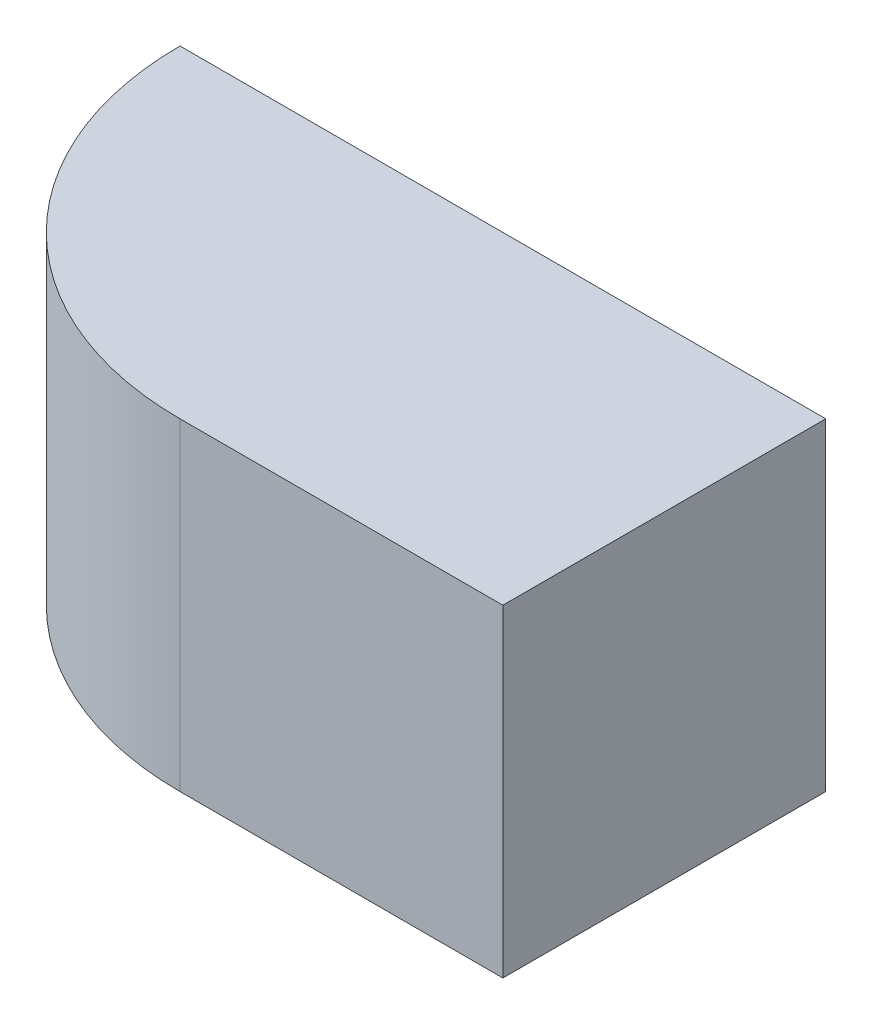
ISO-10303-21;
HEADER;
FILE_DESCRIPTION(('STEP AP214'),'2;1');
FILE_NAME('part.step','',(''),(''),'','','');
FILE_SCHEMA(('AUTOMOTIVE_DESIGN { 1 0 10303 214 1 1 1 1 }'));
ENDSEC;
DATA;
#1=APPLICATION_CONTEXT('core data for automotive mechanical design processes');
#2=APPLICATION_PROTOCOL_DEFINITION('international standard','automotive_design',2000,#1);
#3=PRODUCT_CONTEXT('',#1,'mechanical');
#4=PRODUCT('Part','Part','',(#3));
#5=PRODUCT_RELATED_PRODUCT_CATEGORY('part','',(#4));
#6=PRODUCT_DEFINITION_FORMATION('','',#4);
#7=PRODUCT_DEFINITION_CONTEXT('part definition',#1,'design');
#8=PRODUCT_DEFINITION('design','',#6,#7);
#9=PRODUCT_DEFINITION_SHAPE('','',#8);
#10=(LENGTH_UNIT() NAMED_UNIT(*) SI_UNIT(.MILLI.,.METRE.));
#11=(NAMED_UNIT(*) PLANE_ANGLE_UNIT() SI_UNIT($,.RADIAN.));
#12=(NAMED_UNIT(*) SI_UNIT($,.STERADIAN.) SOLID_ANGLE_UNIT());
#13=UNCERTAINTY_MEASURE_WITH_UNIT(LENGTH_MEASURE(1.E-05),#10,'distance_accuracy_value','');
#14=(GEOMETRIC_REPRESENTATION_CONTEXT(3) GLOBAL_UNCERTAINTY_ASSIGNED_CONTEXT((#13)) GLOBAL_UNIT_ASSIGNED_CONTEXT((#10,
#11,#12)) REPRESENTATION_CONTEXT('',''));
#15=CARTESIAN_POINT('',(0.,0.,0.));
#16=DIRECTION('',(0.,0.,1.));
#17=DIRECTION('',(1.,0.,0.));
#18=AXIS2_PLACEMENT_3D('',#15,#16,#17);
#19=CARTESIAN_POINT('',(-2.00000002980232,-6.75000013038516,2.));
#20=DIRECTION('',(0.,0.,1.));
#21=DIRECTION('',(1.,0.,0.));
#22=AXIS2_PLACEMENT_3D('',#19,#20,#21);
#23=PLANE('',#22);
#24=DIRECTION('',(-1.,0.,0.));
#25=VECTOR('',#24,1.);
#26=CARTESIAN_POINT('',(-1.50000002235174,-7.00000013411045,2.));
#27=LINE('',#26,#25);
#28=CARTESIAN_POINT('',(-1.50000002235174,-7.00000013411045,2.));
#29=VERTEX_POINT('',#28);
#30=CARTESIAN_POINT('',(-2.5000000372529,-7.00000013411045,2.));
#31=VERTEX_POINT('',#30);
#32=EDGE_CURVE('E66',#29,#31,#27,.T.);
#33=ORIENTED_EDGE('',*,*,#32,.T.);
#34=DIRECTION('',(0.,1.,0.));
#35=VECTOR('',#34,1.);
#36=CARTESIAN_POINT('',(-2.5000000372529,-7.00000013411045,2.));
#37=LINE('',#36,#35);
#38=CARTESIAN_POINT('',(-2.5000000372529,-6.50000012665987,2.));
#39=VERTEX_POINT('',#38);
#40=EDGE_CURVE('E82',#31,#39,#37,.T.);
#41=ORIENTED_EDGE('',*,*,#40,.T.);
#42=DIRECTION('',(1.,0.,0.));
#43=VECTOR('',#42,1.);
#44=CARTESIAN_POINT('',(-2.5000000372529,-6.50000012665987,2.));
#45=LINE('',#44,#43);
#46=CARTESIAN_POINT('',(-1.50000002235174,-6.50000012665987,2.));
#47=VERTEX_POINT('',#46);
#48=EDGE_CURVE('E68',#39,#47,#45,.T.);
#49=ORIENTED_EDGE('',*,*,#48,.T.);
#50=DIRECTION('',(0.,-1.,0.));
#51=VECTOR('',#50,1.);
#52=CARTESIAN_POINT('',(-1.50000002235174,-6.50000012665987,2.));
#53=LINE('',#52,#51);
#54=EDGE_CURVE('E28',#47,#29,#53,.T.);
#55=ORIENTED_EDGE('',*,*,#54,.T.);
#56=EDGE_LOOP('',(#33,#41,#49,#55));
#57=FACE_BOUND('',#56,.T.);
#58=ADVANCED_FACE('F17',(#57),#23,.F.);
#59=CARTESIAN_POINT('',(-2.00000002980232,-6.75000013038516,2.5));
#60=DIRECTION('',(0.,0.,1.));
#61=DIRECTION('',(1.,0.,0.));
#62=AXIS2_PLACEMENT_3D('',#59,#60,#61);
#63=PLANE('',#62);
#64=DIRECTION('',(0.,1.,0.));
#65=VECTOR('',#64,1.);
#66=CARTESIAN_POINT('',(-2.0000000372529,-6.62500012852252,2.5));
#67=LINE('',#66,#65);
#68=CARTESIAN_POINT('',(-2.0000000372529,-7.00000013411045,2.5));
#69=VERTEX_POINT('',#68);
#70=CARTESIAN_POINT('',(-2.0000000372529,-6.50000012665987,2.5));
#71=VERTEX_POINT('',#70);
#72=EDGE_CURVE('E91',#69,#71,#67,.T.);
#73=ORIENTED_EDGE('',*,*,#72,.F.);
#74=DIRECTION('',(1.,0.,0.));
#75=VECTOR('',#74,1.);
#76=CARTESIAN_POINT('',(-1.50000002235174,-7.00000013411045,2.5));
#77=LINE('',#76,#75);
#78=CARTESIAN_POINT('',(-1.50000002235174,-7.00000013411045,2.5));
#79=VERTEX_POINT('',#78);
#80=EDGE_CURVE('E76',#69,#79,#77,.T.);
#81=ORIENTED_EDGE('',*,*,#80,.T.);
#82=DIRECTION('',(0.,1.,0.));
#83=VECTOR('',#82,1.);
#84=CARTESIAN_POINT('',(-1.50000002235174,-6.50000012665987,2.5));
#85=LINE('',#84,#83);
#86=CARTESIAN_POINT('',(-1.50000002235174,-6.50000012665987,2.5));
#87=VERTEX_POINT('',#86);
#88=EDGE_CURVE('E11',#79,#87,#85,.T.);
#89=ORIENTED_EDGE('',*,*,#88,.T.);
#90=DIRECTION('',(-1.,0.,0.));
#91=VECTOR('',#90,1.);
#92=CARTESIAN_POINT('',(-2.5000000372529,-6.50000012665987,2.5));
#93=LINE('',#92,#91);
#94=EDGE_CURVE('E93',#87,#71,#93,.T.);
#95=ORIENTED_EDGE('',*,*,#94,.T.);
#96=EDGE_LOOP('',(#73,#81,#89,#95));
#97=FACE_BOUND('',#96,.T.);
#98=ADVANCED_FACE('F121',(#97),#63,.T.);
#99=CARTESIAN_POINT('',(-1.50000002235174,-7.00000013411045,2.));
#100=DIRECTION('',(1.,0.,0.));
#101=DIRECTION('',(0.,1.,0.));
#102=AXIS2_PLACEMENT_3D('',#99,#100,#101);
#103=PLANE('',#102);
#104=ORIENTED_EDGE('',*,*,#54,.F.);
#105=DIRECTION('',(0.,0.,1.));
#106=VECTOR('',#105,1.);
#107=CARTESIAN_POINT('',(-1.50000002235174,-6.50000012665987,2.));
#108=LINE('',#107,#106);
#109=EDGE_CURVE('E97',#47,#87,#108,.T.);
#110=ORIENTED_EDGE('',*,*,#109,.T.);
#111=ORIENTED_EDGE('',*,*,#88,.F.);
#112=DIRECTION('',(0.,0.,1.));
#113=VECTOR('',#112,1.);
#114=CARTESIAN_POINT('',(-1.50000002235174,-7.00000013411045,2.));
#115=LINE('',#114,#113);
#116=EDGE_CURVE('E21',#29,#79,#115,.T.);
#117=ORIENTED_EDGE('',*,*,#116,.F.);
#118=EDGE_LOOP('',(#104,#110,#111,#117));
#119=FACE_BOUND('',#118,.T.);
#120=ADVANCED_FACE('F72',(#119),#103,.T.);
#121=CARTESIAN_POINT('',(-1.50000002235174,-6.50000012665987,2.));
#122=DIRECTION('',(0.,1.,0.));
#123=DIRECTION('',(1.,0.,0.));
#124=AXIS2_PLACEMENT_3D('',#121,#122,#123);
#125=PLANE('',#124);
#126=CARTESIAN_POINT('',(-2.0000000372529,-6.50000012665987,2.));
#127=DIRECTION('',(0.,-1.,0.));
#128=DIRECTION('',(-0.707106781186548,0.,0.707106781186548));
#129=AXIS2_PLACEMENT_3D('',#126,#127,#128);
#130=CIRCLE('',#129,0.5);
#131=EDGE_CURVE('E86',#71,#39,#130,.T.);
#132=ORIENTED_EDGE('',*,*,#131,.F.);
#133=ORIENTED_EDGE('',*,*,#94,.F.);
#134=ORIENTED_EDGE('',*,*,#109,.F.);
#135=ORIENTED_EDGE('',*,*,#48,.F.);
#136=EDGE_LOOP('',(#132,#133,#134,#135));
#137=FACE_BOUND('',#136,.T.);
#138=ADVANCED_FACE('F161',(#137),#125,.T.);
#139=CARTESIAN_POINT('',(-2.5000000372529,-7.00000013411045,2.));
#140=DIRECTION('',(0.,-1.,0.));
#141=DIRECTION('',(0.,0.,-1.));
#142=AXIS2_PLACEMENT_3D('',#139,#140,#141);
#143=PLANE('',#142);
#144=CARTESIAN_POINT('',(-2.0000000372529,-7.00000013411045,2.));
#145=DIRECTION('',(0.,1.,0.));
#146=DIRECTION('',(-0.707106781186548,0.,0.707106781186548));
#147=AXIS2_PLACEMENT_3D('',#144,#145,#146);
#148=CIRCLE('',#147,0.5);
#149=EDGE_CURVE('E80',#31,#69,#148,.T.);
#150=ORIENTED_EDGE('',*,*,#149,.F.);
#151=ORIENTED_EDGE('',*,*,#32,.F.);
#152=ORIENTED_EDGE('',*,*,#116,.T.);
#153=ORIENTED_EDGE('',*,*,#80,.F.);
#154=EDGE_LOOP('',(#150,#151,#152,#153));
#155=FACE_BOUND('',#154,.T.);
#156=ADVANCED_FACE('F78',(#155),#143,.T.);
#157=CARTESIAN_POINT('',(-2.0000000372529,-6.62500012852252,2.));
#158=DIRECTION('',(0.,-1.,0.));
#159=DIRECTION('',(-0.707106781186548,0.,0.707106781186548));
#160=AXIS2_PLACEMENT_3D('',#157,#158,#159);
#161=CYLINDRICAL_SURFACE('',#160,0.5);
#162=ORIENTED_EDGE('',*,*,#149,.T.);
#163=ORIENTED_EDGE('',*,*,#72,.T.);
#164=ORIENTED_EDGE('',*,*,#131,.T.);
#165=ORIENTED_EDGE('',*,*,#40,.F.);
#166=EDGE_LOOP('',(#162,#163,#164,#165));
#167=FACE_BOUND('',#166,.T.);
#168=ADVANCED_FACE('F19',(#167),#161,.T.);
#169=CLOSED_SHELL('',(#58,#98,#120,#138,#156,#168));
#170=MANIFOLD_SOLID_BREP('B1',#169);
#171=ADVANCED_BREP_SHAPE_REPRESENTATION('',(#18,#170),#14);
#172=SHAPE_DEFINITION_REPRESENTATION(#9,#171);
ENDSEC;
END-ISO-10303-21;
